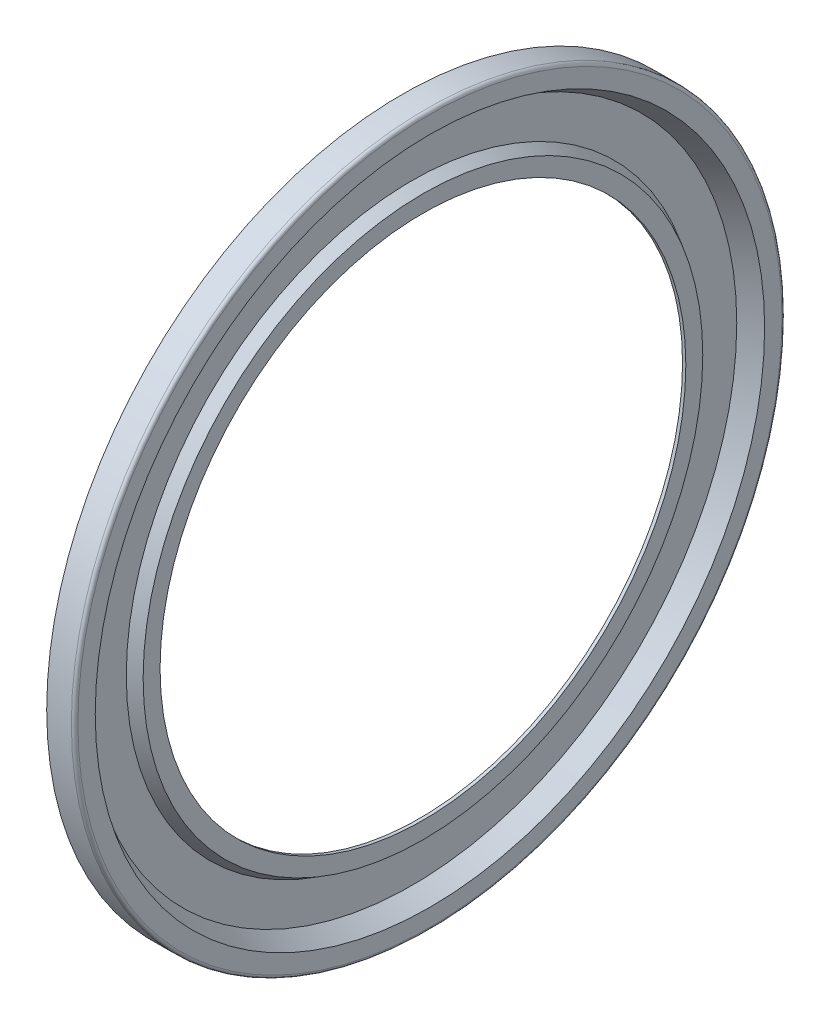
ISO-10303-21;
HEADER;
FILE_DESCRIPTION(('STEP AP214'),'2;1');
FILE_NAME('part.step','',(''),(''),'','','');
FILE_SCHEMA(('AUTOMOTIVE_DESIGN { 1 0 10303 214 1 1 1 1 }'));
ENDSEC;
DATA;
#1=APPLICATION_CONTEXT('core data for automotive mechanical design processes');
#2=APPLICATION_PROTOCOL_DEFINITION('international standard','automotive_design',2000,#1);
#3=PRODUCT_CONTEXT('',#1,'mechanical');
#4=PRODUCT('Part','Part','',(#3));
#5=PRODUCT_RELATED_PRODUCT_CATEGORY('part','',(#4));
#6=PRODUCT_DEFINITION_FORMATION('','',#4);
#7=PRODUCT_DEFINITION_CONTEXT('part definition',#1,'design');
#8=PRODUCT_DEFINITION('design','',#6,#7);
#9=PRODUCT_DEFINITION_SHAPE('','',#8);
#10=(LENGTH_UNIT() NAMED_UNIT(*) SI_UNIT(.MILLI.,.METRE.));
#11=(NAMED_UNIT(*) PLANE_ANGLE_UNIT() SI_UNIT($,.RADIAN.));
#12=(NAMED_UNIT(*) SI_UNIT($,.STERADIAN.) SOLID_ANGLE_UNIT());
#13=UNCERTAINTY_MEASURE_WITH_UNIT(LENGTH_MEASURE(1.E-05),#10,'distance_accuracy_value','');
#14=(GEOMETRIC_REPRESENTATION_CONTEXT(3) GLOBAL_UNCERTAINTY_ASSIGNED_CONTEXT((#13)) GLOBAL_UNIT_ASSIGNED_CONTEXT((#10,
#11,#12)) REPRESENTATION_CONTEXT('',''));
#15=CARTESIAN_POINT('',(0.,0.,0.));
#16=DIRECTION('',(0.,0.,1.));
#17=DIRECTION('',(1.,0.,0.));
#18=AXIS2_PLACEMENT_3D('',#15,#16,#17);
#19=CARTESIAN_POINT('',(1.89,0.,20.8978257696894));
#20=DIRECTION('',(1.,0.,0.));
#21=DIRECTION('',(0.,1.,0.));
#22=AXIS2_PLACEMENT_3D('',#19,#20,#21);
#23=PLANE('',#22);
#24=CARTESIAN_POINT('',(1.89,0.,0.));
#25=DIRECTION('',(-1.,0.,0.));
#26=DIRECTION('',(0.,0.,1.));
#27=AXIS2_PLACEMENT_3D('',#24,#25,#26);
#28=CIRCLE('',#27,21.425);
#29=CARTESIAN_POINT('',(1.89,0.,21.425));
#30=VERTEX_POINT('',#29);
#31=EDGE_CURVE('E68',#30,#30,#28,.T.);
#32=ORIENTED_EDGE('',*,*,#31,.F.);
#33=EDGE_LOOP('',(#32));
#34=FACE_BOUND('',#33,.T.);
#35=CARTESIAN_POINT('',(1.89,0.,0.));
#36=DIRECTION('',(1.,0.,0.));
#37=DIRECTION('',(0.,0.,-1.));
#38=AXIS2_PLACEMENT_3D('',#35,#36,#37);
#39=CIRCLE('',#38,20.3706515393789);
#40=CARTESIAN_POINT('',(1.89,0.,-20.3706515393789));
#41=VERTEX_POINT('',#40);
#42=EDGE_CURVE('E18',#41,#41,#39,.T.);
#43=ORIENTED_EDGE('',*,*,#42,.F.);
#44=EDGE_LOOP('',(#43));
#45=FACE_BOUND('',#44,.T.);
#46=ADVANCED_FACE('F14',(#34,#45),#23,.T.);
#47=CARTESIAN_POINT('',(1.69,0.,0.));
#48=DIRECTION('',(1.,0.,0.));
#49=DIRECTION('',(0.,1.,0.));
#50=AXIS2_PLACEMENT_3D('',#47,#48,#49);
#51=TOROIDAL_SURFACE('',#50,21.425,0.199999999999999);
#52=CARTESIAN_POINT('',(1.69,0.,0.));
#53=DIRECTION('',(1.,0.,0.));
#54=DIRECTION('',(0.,0.,-1.));
#55=AXIS2_PLACEMENT_3D('',#52,#53,#54);
#56=CIRCLE('',#55,21.625);
#57=CARTESIAN_POINT('',(1.69,0.,-21.625));
#58=VERTEX_POINT('',#57);
#59=EDGE_CURVE('E60',#58,#58,#56,.F.);
#60=ORIENTED_EDGE('',*,*,#59,.F.);
#61=EDGE_LOOP('',(#60));
#62=FACE_BOUND('',#61,.T.);
#63=ORIENTED_EDGE('',*,*,#31,.T.);
#64=EDGE_LOOP('',(#63));
#65=FACE_BOUND('',#64,.T.);
#66=ADVANCED_FACE('F77',(#62,#65),#51,.T.);
#67=CARTESIAN_POINT('',(0.815000000000004,0.,0.));
#68=DIRECTION('',(1.,0.,0.));
#69=DIRECTION('',(0.,0.,-1.));
#70=AXIS2_PLACEMENT_3D('',#67,#68,#69);
#71=CONICAL_SURFACE('',#70,19.75,0.523598775598299);
#72=CARTESIAN_POINT('',(0.815000000000003,0.,0.));
#73=DIRECTION('',(1.,0.,0.));
#74=DIRECTION('',(0.,0.,-1.));
#75=AXIS2_PLACEMENT_3D('',#72,#73,#74);
#76=CIRCLE('',#75,19.75);
#77=CARTESIAN_POINT('',(0.815000000000003,0.,-19.75));
#78=VERTEX_POINT('',#77);
#79=EDGE_CURVE('E58',#78,#78,#76,.T.);
#80=ORIENTED_EDGE('',*,*,#79,.F.);
#81=EDGE_LOOP('',(#80));
#82=FACE_BOUND('',#81,.T.);
#83=ORIENTED_EDGE('',*,*,#42,.T.);
#84=EDGE_LOOP('',(#83));
#85=FACE_BOUND('',#84,.T.);
#86=ADVANCED_FACE('F81',(#82,#85),#71,.F.);
#87=CARTESIAN_POINT('',(0.94,0.,0.));
#88=DIRECTION('',(1.,0.,0.));
#89=DIRECTION('',(0.,0.,-1.));
#90=AXIS2_PLACEMENT_3D('',#87,#88,#89);
#91=CYLINDRICAL_SURFACE('',#90,21.625);
#92=ORIENTED_EDGE('',*,*,#59,.T.);
#93=EDGE_LOOP('',(#92));
#94=FACE_BOUND('',#93,.T.);
#95=CARTESIAN_POINT('',(0.19,0.,0.));
#96=DIRECTION('',(1.,0.,0.));
#97=DIRECTION('',(0.,0.,-1.));
#98=AXIS2_PLACEMENT_3D('',#95,#96,#97);
#99=CIRCLE('',#98,21.625);
#100=CARTESIAN_POINT('',(0.19,0.,-21.625));
#101=VERTEX_POINT('',#100);
#102=EDGE_CURVE('E56',#101,#101,#99,.F.);
#103=ORIENTED_EDGE('',*,*,#102,.F.);
#104=EDGE_LOOP('',(#103));
#105=FACE_BOUND('',#104,.T.);
#106=ADVANCED_FACE('F85',(#94,#105),#91,.T.);
#107=CARTESIAN_POINT('',(0.815,0.,18.578125));
#108=DIRECTION('',(1.,0.,0.));
#109=DIRECTION('',(0.,0.,-1.));
#110=AXIS2_PLACEMENT_3D('',#107,#108,#109);
#111=PLANE('',#110);
#112=ORIENTED_EDGE('',*,*,#79,.T.);
#113=EDGE_LOOP('',(#112));
#114=FACE_BOUND('',#113,.T.);
#115=CARTESIAN_POINT('',(0.815,0.,0.));
#116=DIRECTION('',(-1.,0.,0.));
#117=DIRECTION('',(0.,0.,1.));
#118=AXIS2_PLACEMENT_3D('',#115,#116,#117);
#119=CIRCLE('',#118,17.40625);
#120=CARTESIAN_POINT('',(0.815,0.,17.40625));
#121=VERTEX_POINT('',#120);
#122=EDGE_CURVE('E53',#121,#121,#119,.F.);
#123=ORIENTED_EDGE('',*,*,#122,.F.);
#124=EDGE_LOOP('',(#123));
#125=FACE_BOUND('',#124,.T.);
#126=ADVANCED_FACE('F89',(#114,#125),#111,.T.);
#127=CARTESIAN_POINT('',(0.19,0.,21.525));
#128=DIRECTION('',(-1.,0.,0.));
#129=DIRECTION('',(0.,0.,1.));
#130=AXIS2_PLACEMENT_3D('',#127,#128,#129);
#131=PLANE('',#130);
#132=CARTESIAN_POINT('',(0.19,0.,0.));
#133=DIRECTION('',(1.,0.,0.));
#134=DIRECTION('',(0.,0.,-1.));
#135=AXIS2_PLACEMENT_3D('',#132,#133,#134);
#136=CIRCLE('',#135,21.425);
#137=CARTESIAN_POINT('',(0.19,0.,-21.425));
#138=VERTEX_POINT('',#137);
#139=EDGE_CURVE('E50',#138,#138,#136,.F.);
#140=ORIENTED_EDGE('',*,*,#139,.F.);
#141=EDGE_LOOP('',(#140));
#142=FACE_BOUND('',#141,.T.);
#143=ORIENTED_EDGE('',*,*,#102,.T.);
#144=EDGE_LOOP('',(#143));
#145=FACE_BOUND('',#144,.T.);
#146=ADVANCED_FACE('F92',(#142,#145),#131,.T.);
#147=CARTESIAN_POINT('',(0.815000000000001,0.,0.));
#148=DIRECTION('',(-1.,0.,0.));
#149=DIRECTION('',(0.,0.,1.));
#150=AXIS2_PLACEMENT_3D('',#147,#148,#149);
#151=CONICAL_SURFACE('',#150,17.40625,0.523598775598301);
#152=CARTESIAN_POINT('',(1.465,0.,0.));
#153=DIRECTION('',(-1.,0.,0.));
#154=DIRECTION('',(0.,0.,1.));
#155=AXIS2_PLACEMENT_3D('',#152,#153,#154);
#156=CIRCLE('',#155,17.0309723250267);
#157=CARTESIAN_POINT('',(1.465,0.,17.0309723250267));
#158=VERTEX_POINT('',#157);
#159=EDGE_CURVE('E47',#158,#158,#156,.F.);
#160=ORIENTED_EDGE('',*,*,#159,.F.);
#161=EDGE_LOOP('',(#160));
#162=FACE_BOUND('',#161,.T.);
#163=ORIENTED_EDGE('',*,*,#122,.T.);
#164=EDGE_LOOP('',(#163));
#165=FACE_BOUND('',#164,.T.);
#166=ADVANCED_FACE('F95',(#162,#165),#151,.T.);
#167=CARTESIAN_POINT('',(0.19,0.,0.));
#168=DIRECTION('',(1.,0.,0.));
#169=DIRECTION('',(0.,0.,-1.));
#170=AXIS2_PLACEMENT_3D('',#167,#168,#169);
#171=CYLINDRICAL_SURFACE('',#170,21.425);
#172=ORIENTED_EDGE('',*,*,#139,.T.);
#173=EDGE_LOOP('',(#172));
#174=FACE_BOUND('',#173,.T.);
#175=CARTESIAN_POINT('',(1.59,0.,0.));
#176=DIRECTION('',(1.,0.,0.));
#177=DIRECTION('',(0.,1.,0.));
#178=AXIS2_PLACEMENT_3D('',#175,#176,#177);
#179=CIRCLE('',#178,21.425);
#180=CARTESIAN_POINT('',(1.59,21.425,0.));
#181=VERTEX_POINT('',#180);
#182=EDGE_CURVE('E46',#181,#181,#179,.F.);
#183=ORIENTED_EDGE('',*,*,#182,.F.);
#184=EDGE_LOOP('',(#183));
#185=FACE_BOUND('',#184,.T.);
#186=ADVANCED_FACE('F99',(#174,#185),#171,.F.);
#187=CARTESIAN_POINT('',(1.465,0.,16.5154861625134));
#188=DIRECTION('',(1.,0.,0.));
#189=DIRECTION('',(0.,1.,0.));
#190=AXIS2_PLACEMENT_3D('',#187,#188,#189);
#191=PLANE('',#190);
#192=ORIENTED_EDGE('',*,*,#159,.T.);
#193=EDGE_LOOP('',(#192));
#194=FACE_BOUND('',#193,.T.);
#195=CARTESIAN_POINT('',(1.465,0.,0.));
#196=DIRECTION('',(1.,0.,0.));
#197=DIRECTION('',(0.,0.,-1.));
#198=AXIS2_PLACEMENT_3D('',#195,#196,#197);
#199=CIRCLE('',#198,16.);
#200=CARTESIAN_POINT('',(1.465,0.,-16.));
#201=VERTEX_POINT('',#200);
#202=EDGE_CURVE('E43',#201,#201,#199,.T.);
#203=ORIENTED_EDGE('',*,*,#202,.F.);
#204=EDGE_LOOP('',(#203));
#205=FACE_BOUND('',#204,.T.);
#206=ADVANCED_FACE('F103',(#194,#205),#191,.T.);
#207=CARTESIAN_POINT('',(1.59,0.,0.));
#208=DIRECTION('',(1.,0.,0.));
#209=DIRECTION('',(0.,1.,0.));
#210=AXIS2_PLACEMENT_3D('',#207,#208,#209);
#211=TOROIDAL_SURFACE('',#210,21.325,0.100000000000003);
#212=CARTESIAN_POINT('',(1.69,0.,0.));
#213=DIRECTION('',(1.,0.,0.));
#214=DIRECTION('',(0.,0.,1.));
#215=AXIS2_PLACEMENT_3D('',#212,#213,#214);
#216=CIRCLE('',#215,21.325);
#217=CARTESIAN_POINT('',(1.69,0.,21.325));
#218=VERTEX_POINT('',#217);
#219=EDGE_CURVE('E42',#218,#218,#216,.F.);
#220=ORIENTED_EDGE('',*,*,#219,.F.);
#221=EDGE_LOOP('',(#220));
#222=FACE_BOUND('',#221,.T.);
#223=ORIENTED_EDGE('',*,*,#182,.T.);
#224=EDGE_LOOP('',(#223));
#225=FACE_BOUND('',#224,.T.);
#226=ADVANCED_FACE('F107',(#222,#225),#211,.F.);
#227=CARTESIAN_POINT('',(1.265,0.,0.));
#228=DIRECTION('',(1.,0.,0.));
#229=DIRECTION('',(0.,0.,-1.));
#230=AXIS2_PLACEMENT_3D('',#227,#228,#229);
#231=CYLINDRICAL_SURFACE('',#230,16.);
#232=CARTESIAN_POINT('',(1.265,0.,0.));
#233=DIRECTION('',(1.,0.,0.));
#234=DIRECTION('',(0.,0.,-1.));
#235=AXIS2_PLACEMENT_3D('',#232,#233,#234);
#236=CIRCLE('',#235,16.);
#237=CARTESIAN_POINT('',(1.265,0.,-16.));
#238=VERTEX_POINT('',#237);
#239=EDGE_CURVE('E39',#238,#238,#236,.T.);
#240=ORIENTED_EDGE('',*,*,#239,.F.);
#241=EDGE_LOOP('',(#240));
#242=FACE_BOUND('',#241,.T.);
#243=ORIENTED_EDGE('',*,*,#202,.T.);
#244=EDGE_LOOP('',(#243));
#245=FACE_BOUND('',#244,.T.);
#246=ADVANCED_FACE('F113',(#242,#245),#231,.F.);
#247=CARTESIAN_POINT('',(1.69,0.,20.9055607966084));
#248=DIRECTION('',(-1.,0.,0.));
#249=DIRECTION('',(0.,0.,1.));
#250=AXIS2_PLACEMENT_3D('',#247,#248,#249);
#251=PLANE('',#250);
#252=CARTESIAN_POINT('',(1.69,0.,0.));
#253=DIRECTION('',(1.,0.,0.));
#254=DIRECTION('',(0.,0.,-1.));
#255=AXIS2_PLACEMENT_3D('',#252,#253,#254);
#256=CIRCLE('',#255,20.4861215932168);
#257=CARTESIAN_POINT('',(1.69,0.,-20.4861215932168));
#258=VERTEX_POINT('',#257);
#259=EDGE_CURVE('E36',#258,#258,#256,.F.);
#260=ORIENTED_EDGE('',*,*,#259,.F.);
#261=EDGE_LOOP('',(#260));
#262=FACE_BOUND('',#261,.T.);
#263=ORIENTED_EDGE('',*,*,#219,.T.);
#264=EDGE_LOOP('',(#263));
#265=FACE_BOUND('',#264,.T.);
#266=ADVANCED_FACE('F137',(#262,#265),#251,.T.);
#267=CARTESIAN_POINT('',(1.265,0.,16.4577511355944));
#268=DIRECTION('',(-1.,0.,0.));
#269=DIRECTION('',(0.,0.,1.));
#270=AXIS2_PLACEMENT_3D('',#267,#268,#269);
#271=PLANE('',#270);
#272=ORIENTED_EDGE('',*,*,#239,.T.);
#273=EDGE_LOOP('',(#272));
#274=FACE_BOUND('',#273,.T.);
#275=CARTESIAN_POINT('',(1.265,0.,0.));
#276=DIRECTION('',(-1.,0.,0.));
#277=DIRECTION('',(0.,0.,1.));
#278=AXIS2_PLACEMENT_3D('',#275,#276,#277);
#279=CIRCLE('',#278,16.9155022711888);
#280=CARTESIAN_POINT('',(1.265,0.,16.9155022711888));
#281=VERTEX_POINT('',#280);
#282=EDGE_CURVE('E27',#281,#281,#279,.F.);
#283=ORIENTED_EDGE('',*,*,#282,.F.);
#284=EDGE_LOOP('',(#283));
#285=FACE_BOUND('',#284,.T.);
#286=ADVANCED_FACE('F139',(#274,#285),#271,.T.);
#287=CARTESIAN_POINT('',(1.69,0.,0.));
#288=DIRECTION('',(1.,0.,0.));
#289=DIRECTION('',(0.,0.,-1.));
#290=AXIS2_PLACEMENT_3D('',#287,#288,#289);
#291=CONICAL_SURFACE('',#290,20.4861215932168,0.523598775598299);
#292=ORIENTED_EDGE('',*,*,#259,.T.);
#293=EDGE_LOOP('',(#292));
#294=FACE_BOUND('',#293,.T.);
#295=CARTESIAN_POINT('',(0.614999999999998,0.,0.));
#296=DIRECTION('',(1.,0.,0.));
#297=DIRECTION('',(0.,0.,-1.));
#298=AXIS2_PLACEMENT_3D('',#295,#296,#297);
#299=CIRCLE('',#298,19.8654700538379);
#300=CARTESIAN_POINT('',(0.614999999999998,0.,-19.8654700538379));
#301=VERTEX_POINT('',#300);
#302=EDGE_CURVE('E22',#301,#301,#299,.F.);
#303=ORIENTED_EDGE('',*,*,#302,.F.);
#304=EDGE_LOOP('',(#303));
#305=FACE_BOUND('',#304,.T.);
#306=ADVANCED_FACE('F146',(#294,#305),#291,.T.);
#307=CARTESIAN_POINT('',(1.265,0.,0.));
#308=DIRECTION('',(-1.,0.,0.));
#309=DIRECTION('',(0.,0.,1.));
#310=AXIS2_PLACEMENT_3D('',#307,#308,#309);
#311=CONICAL_SURFACE('',#310,16.9155022711888,0.5235987755983);
#312=CARTESIAN_POINT('',(0.615000000000001,0.,0.));
#313=DIRECTION('',(-1.,0.,0.));
#314=DIRECTION('',(0.,0.,1.));
#315=AXIS2_PLACEMENT_3D('',#312,#313,#314);
#316=CIRCLE('',#315,17.2907799461621);
#317=CARTESIAN_POINT('',(0.615000000000001,0.,17.2907799461621));
#318=VERTEX_POINT('',#317);
#319=EDGE_CURVE('E10',#318,#318,#316,.F.);
#320=ORIENTED_EDGE('',*,*,#319,.F.);
#321=EDGE_LOOP('',(#320));
#322=FACE_BOUND('',#321,.T.);
#323=ORIENTED_EDGE('',*,*,#282,.T.);
#324=EDGE_LOOP('',(#323));
#325=FACE_BOUND('',#324,.T.);
#326=ADVANCED_FACE('F154',(#322,#325),#311,.F.);
#327=CARTESIAN_POINT('',(0.615,0.,18.578125));
#328=DIRECTION('',(-1.,0.,0.));
#329=DIRECTION('',(0.,0.,1.));
#330=AXIS2_PLACEMENT_3D('',#327,#328,#329);
#331=PLANE('',#330);
#332=ORIENTED_EDGE('',*,*,#319,.T.);
#333=EDGE_LOOP('',(#332));
#334=FACE_BOUND('',#333,.T.);
#335=ORIENTED_EDGE('',*,*,#302,.T.);
#336=EDGE_LOOP('',(#335));
#337=FACE_BOUND('',#336,.T.);
#338=ADVANCED_FACE('F152',(#334,#337),#331,.T.);
#339=CLOSED_SHELL('',(#46,#66,#86,#106,#126,#146,#166,#186,#206,#226,#246,#266,#286,#306,#326,#338));
#340=MANIFOLD_SOLID_BREP('B1',#339);
#341=ADVANCED_BREP_SHAPE_REPRESENTATION('',(#18,#340),#14);
#342=SHAPE_DEFINITION_REPRESENTATION(#9,#341);
ENDSEC;
END-ISO-10303-21;
